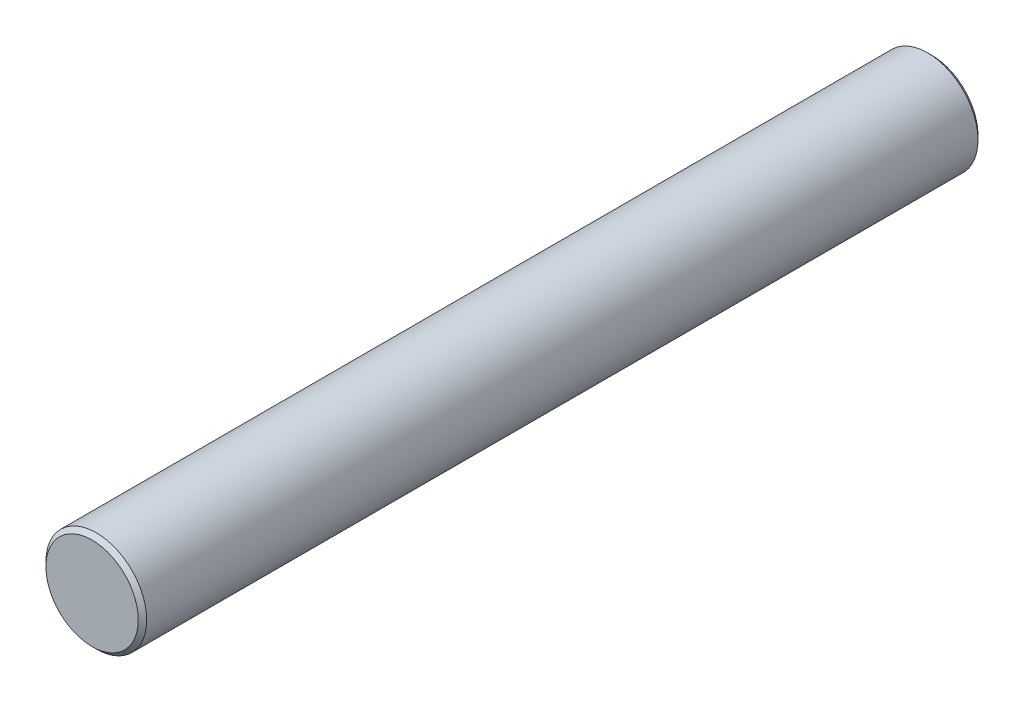
ISO-10303-21;
HEADER;
FILE_DESCRIPTION(('STEP AP214'),'2;1');
FILE_NAME('part.step','',(''),(''),'','','');
FILE_SCHEMA(('AUTOMOTIVE_DESIGN { 1 0 10303 214 1 1 1 1 }'));
ENDSEC;
DATA;
#1=APPLICATION_CONTEXT('core data for automotive mechanical design processes');
#2=APPLICATION_PROTOCOL_DEFINITION('international standard','automotive_design',2000,#1);
#3=PRODUCT_CONTEXT('',#1,'mechanical');
#4=PRODUCT('Part','Part','',(#3));
#5=PRODUCT_RELATED_PRODUCT_CATEGORY('part','',(#4));
#6=PRODUCT_DEFINITION_FORMATION('','',#4);
#7=PRODUCT_DEFINITION_CONTEXT('part definition',#1,'design');
#8=PRODUCT_DEFINITION('design','',#6,#7);
#9=PRODUCT_DEFINITION_SHAPE('','',#8);
#10=(LENGTH_UNIT() NAMED_UNIT(*) SI_UNIT(.MILLI.,.METRE.));
#11=(NAMED_UNIT(*) PLANE_ANGLE_UNIT() SI_UNIT($,.RADIAN.));
#12=(NAMED_UNIT(*) SI_UNIT($,.STERADIAN.) SOLID_ANGLE_UNIT());
#13=UNCERTAINTY_MEASURE_WITH_UNIT(LENGTH_MEASURE(1.E-05),#10,'distance_accuracy_value','');
#14=(GEOMETRIC_REPRESENTATION_CONTEXT(3) GLOBAL_UNCERTAINTY_ASSIGNED_CONTEXT((#13)) GLOBAL_UNIT_ASSIGNED_CONTEXT((#10,
#11,#12)) REPRESENTATION_CONTEXT('',''));
#15=CARTESIAN_POINT('',(0.,0.,0.));
#16=DIRECTION('',(0.,0.,1.));
#17=DIRECTION('',(1.,0.,0.));
#18=AXIS2_PLACEMENT_3D('',#15,#16,#17);
#19=CARTESIAN_POINT('',(0.,0.,100.));
#20=DIRECTION('',(0.,0.,-1.));
#21=DIRECTION('',(-1.,0.,0.));
#22=AXIS2_PLACEMENT_3D('',#19,#20,#21);
#23=CYLINDRICAL_SURFACE('',#22,6.);
#24=CARTESIAN_POINT('',(0.,0.,0.499999999999987));
#25=DIRECTION('',(0.,0.,1.));
#26=DIRECTION('',(1.,0.,0.));
#27=AXIS2_PLACEMENT_3D('',#24,#25,#26);
#28=CIRCLE('',#27,6.);
#29=CARTESIAN_POINT('',(6.,0.,0.499999999999987));
#30=VERTEX_POINT('',#29);
#31=EDGE_CURVE('E42',#30,#30,#28,.T.);
#32=ORIENTED_EDGE('',*,*,#31,.T.);
#33=EDGE_LOOP('',(#32));
#34=FACE_BOUND('',#33,.T.);
#35=CARTESIAN_POINT('',(0.,0.,99.5));
#36=DIRECTION('',(0.,0.,1.));
#37=DIRECTION('',(1.,0.,0.));
#38=AXIS2_PLACEMENT_3D('',#35,#36,#37);
#39=CIRCLE('',#38,6.);
#40=CARTESIAN_POINT('',(6.,0.,99.5));
#41=VERTEX_POINT('',#40);
#42=EDGE_CURVE('E46',#41,#41,#39,.F.);
#43=ORIENTED_EDGE('',*,*,#42,.T.);
#44=EDGE_LOOP('',(#43));
#45=FACE_BOUND('',#44,.T.);
#46=ADVANCED_FACE('F31',(#34,#45),#23,.T.);
#47=CARTESIAN_POINT('',(0.,0.,100.));
#48=DIRECTION('',(0.,0.,1.));
#49=DIRECTION('',(1.,0.,0.));
#50=AXIS2_PLACEMENT_3D('',#47,#48,#49);
#51=PLANE('',#50);
#52=CARTESIAN_POINT('',(0.,0.,100.));
#53=DIRECTION('',(0.,0.,1.));
#54=DIRECTION('',(1.,0.,0.));
#55=AXIS2_PLACEMENT_3D('',#52,#53,#54);
#56=CIRCLE('',#55,5.50000000000001);
#57=CARTESIAN_POINT('',(5.50000000000001,0.,100.));
#58=VERTEX_POINT('',#57);
#59=EDGE_CURVE('E10',#58,#58,#56,.T.);
#60=ORIENTED_EDGE('',*,*,#59,.T.);
#61=EDGE_LOOP('',(#60));
#62=FACE_BOUND('',#61,.T.);
#63=ADVANCED_FACE('F62',(#62),#51,.T.);
#64=CARTESIAN_POINT('',(0.,0.,0.));
#65=DIRECTION('',(0.,0.,1.));
#66=DIRECTION('',(1.,0.,0.));
#67=AXIS2_PLACEMENT_3D('',#64,#65,#66);
#68=PLANE('',#67);
#69=CARTESIAN_POINT('',(0.,0.,0.));
#70=DIRECTION('',(0.,0.,1.));
#71=DIRECTION('',(1.,0.,0.));
#72=AXIS2_PLACEMENT_3D('',#69,#70,#71);
#73=CIRCLE('',#72,5.50000000000002);
#74=CARTESIAN_POINT('',(5.50000000000002,0.,0.));
#75=VERTEX_POINT('',#74);
#76=EDGE_CURVE('E38',#75,#75,#73,.F.);
#77=ORIENTED_EDGE('',*,*,#76,.T.);
#78=EDGE_LOOP('',(#77));
#79=FACE_BOUND('',#78,.T.);
#80=ADVANCED_FACE('F59',(#79),#68,.F.);
#81=CARTESIAN_POINT('',(0.,0.,0.499999999999987));
#82=DIRECTION('',(0.,0.,1.));
#83=DIRECTION('',(1.,0.,0.));
#84=AXIS2_PLACEMENT_3D('',#81,#82,#83);
#85=CONICAL_SURFACE('',#84,6.,0.785398163397443);
#86=ORIENTED_EDGE('',*,*,#76,.F.);
#87=EDGE_LOOP('',(#86));
#88=FACE_BOUND('',#87,.T.);
#89=ORIENTED_EDGE('',*,*,#31,.F.);
#90=EDGE_LOOP('',(#89));
#91=FACE_BOUND('',#90,.T.);
#92=ADVANCED_FACE('F55',(#88,#91),#85,.T.);
#93=CARTESIAN_POINT('',(0.,0.,100.));
#94=DIRECTION('',(0.,0.,-1.));
#95=DIRECTION('',(-1.,0.,0.));
#96=AXIS2_PLACEMENT_3D('',#93,#94,#95);
#97=CONICAL_SURFACE('',#96,5.50000000000001,0.785398163397458);
#98=ORIENTED_EDGE('',*,*,#42,.F.);
#99=EDGE_LOOP('',(#98));
#100=FACE_BOUND('',#99,.T.);
#101=ORIENTED_EDGE('',*,*,#59,.F.);
#102=EDGE_LOOP('',(#101));
#103=FACE_BOUND('',#102,.T.);
#104=ADVANCED_FACE('F33',(#100,#103),#97,.T.);
#105=CLOSED_SHELL('',(#46,#63,#80,#92,#104));
#106=MANIFOLD_SOLID_BREP('B2',#105);
#107=ADVANCED_BREP_SHAPE_REPRESENTATION('',(#18,#106),#14);
#108=SHAPE_DEFINITION_REPRESENTATION(#9,#107);
ENDSEC;
END-ISO-10303-21;
